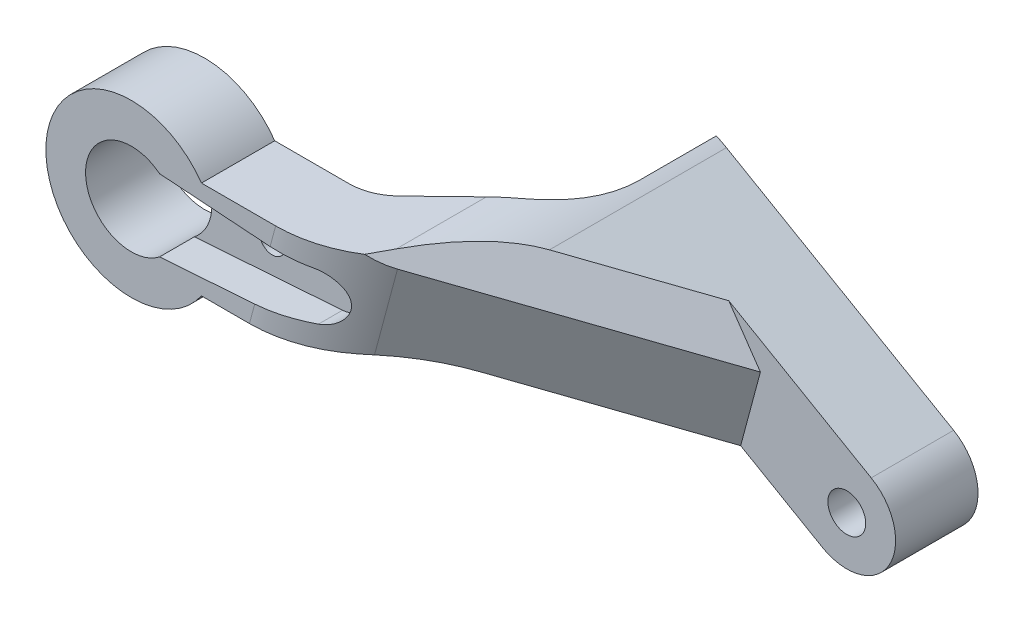
ISO-10303-21;
HEADER;
FILE_DESCRIPTION(('STEP AP214'),'2;1');
FILE_NAME('part.step','',(''),(''),'','','');
FILE_SCHEMA(('AUTOMOTIVE_DESIGN { 1 0 10303 214 1 1 1 1 }'));
ENDSEC;
DATA;
#1=APPLICATION_CONTEXT('core data for automotive mechanical design processes');
#2=APPLICATION_PROTOCOL_DEFINITION('international standard','automotive_design',2000,#1);
#3=PRODUCT_CONTEXT('',#1,'mechanical');
#4=PRODUCT('Part','Part','',(#3));
#5=PRODUCT_RELATED_PRODUCT_CATEGORY('part','',(#4));
#6=PRODUCT_DEFINITION_FORMATION('','',#4);
#7=PRODUCT_DEFINITION_CONTEXT('part definition',#1,'design');
#8=PRODUCT_DEFINITION('design','',#6,#7);
#9=PRODUCT_DEFINITION_SHAPE('','',#8);
#10=(LENGTH_UNIT() NAMED_UNIT(*) SI_UNIT(.MILLI.,.METRE.));
#11=(NAMED_UNIT(*) PLANE_ANGLE_UNIT() SI_UNIT($,.RADIAN.));
#12=(NAMED_UNIT(*) SI_UNIT($,.STERADIAN.) SOLID_ANGLE_UNIT());
#13=UNCERTAINTY_MEASURE_WITH_UNIT(LENGTH_MEASURE(1.E-05),#10,'distance_accuracy_value','');
#14=(GEOMETRIC_REPRESENTATION_CONTEXT(3) GLOBAL_UNCERTAINTY_ASSIGNED_CONTEXT((#13)) GLOBAL_UNIT_ASSIGNED_CONTEXT((#10,
#11,#12)) REPRESENTATION_CONTEXT('',''));
#15=CARTESIAN_POINT('',(0.,0.,0.));
#16=DIRECTION('',(0.,0.,1.));
#17=DIRECTION('',(1.,0.,0.));
#18=AXIS2_PLACEMENT_3D('',#15,#16,#17);
#19=CARTESIAN_POINT('',(0.,0.,-25.35));
#20=DIRECTION('',(0.,0.,1.));
#21=DIRECTION('',(1.,0.,0.));
#22=AXIS2_PLACEMENT_3D('',#19,#20,#21);
#23=PLANE('',#22);
#24=DIRECTION('',(-0.258819045102521,-0.965925826289068,0.));
#25=VECTOR('',#24,1.);
#26=CARTESIAN_POINT('',(17.8819508450437,-14.4014203161296,-25.35));
#27=LINE('',#26,#25);
#28=CARTESIAN_POINT('',(22.5678321839119,3.08652691876553,-25.35));
#29=VERTEX_POINT('',#28);
#30=CARTESIAN_POINT('',(20.4242386444629,-4.91347308123447,-25.35));
#31=VERTEX_POINT('',#30);
#32=EDGE_CURVE('E279',#29,#31,#27,.T.);
#33=ORIENTED_EDGE('',*,*,#32,.F.);
#34=CARTESIAN_POINT('',(18.3923048454133,-6.,-25.35));
#35=DIRECTION('',(0.,0.,1.));
#36=DIRECTION('',(1.,0.,0.));
#37=AXIS2_PLACEMENT_3D('',#34,#35,#36);
#38=CIRCLE('',#37,10.);
#39=CARTESIAN_POINT('',(23.3923048454133,2.66025403784438,-25.35));
#40=VERTEX_POINT('',#39);
#41=EDGE_CURVE('E317',#29,#40,#38,.F.);
#42=ORIENTED_EDGE('',*,*,#41,.T.);
#43=DIRECTION('',(-0.866025403784438,0.500000000000001,0.));
#44=VECTOR('',#43,1.);
#45=CARTESIAN_POINT('',(7.00000000000003,12.1243556529822,-25.35));
#46=LINE('',#45,#44);
#47=CARTESIAN_POINT('',(42.,-8.0829037686548,-25.35));
#48=VERTEX_POINT('',#47);
#49=EDGE_CURVE('E289',#48,#40,#46,.T.);
#50=ORIENTED_EDGE('',*,*,#49,.F.);
#51=CARTESIAN_POINT('',(40.,-11.5470053837925,-25.35));
#52=DIRECTION('',(0.,0.,1.));
#53=DIRECTION('',(1.,0.,0.));
#54=AXIS2_PLACEMENT_3D('',#51,#52,#53);
#55=CIRCLE('',#54,4.);
#56=CARTESIAN_POINT('',(38.,-15.0111069989303,-25.35));
#57=VERTEX_POINT('',#56);
#58=EDGE_CURVE('E288',#48,#57,#55,.F.);
#59=ORIENTED_EDGE('',*,*,#58,.T.);
#60=DIRECTION('',(-0.866025403784438,0.500000000000001,0.));
#61=VECTOR('',#60,1.);
#62=CARTESIAN_POINT('',(3.00000000000002,5.19615242270665,-25.35));
#63=LINE('',#62,#61);
#64=CARTESIAN_POINT('',(21.2487113059643,-5.33974596215562,-25.35));
#65=VERTEX_POINT('',#64);
#66=EDGE_CURVE('E284',#57,#65,#63,.T.);
#67=ORIENTED_EDGE('',*,*,#66,.T.);
#68=CARTESIAN_POINT('',(16.2487113059643,-14.,-25.35));
#69=DIRECTION('',(0.,0.,1.));
#70=DIRECTION('',(1.,0.,0.));
#71=AXIS2_PLACEMENT_3D('',#68,#69,#70);
#72=CIRCLE('',#71,10.);
#73=EDGE_CURVE('E326',#65,#31,#72,.T.);
#74=ORIENTED_EDGE('',*,*,#73,.T.);
#75=EDGE_LOOP('',(#33,#42,#50,#59,#67,#74));
#76=FACE_BOUND('',#75,.T.);
#77=CARTESIAN_POINT('',(40.,-11.5470053837925,-25.35));
#78=DIRECTION('',(0.,0.,1.));
#79=DIRECTION('',(1.,0.,0.));
#80=AXIS2_PLACEMENT_3D('',#77,#78,#79);
#81=CIRCLE('',#80,1.55);
#82=CARTESIAN_POINT('',(41.55,-11.5470053837925,-25.35));
#83=VERTEX_POINT('',#82);
#84=EDGE_CURVE('E283',#83,#83,#81,.F.);
#85=ORIENTED_EDGE('',*,*,#84,.F.);
#86=EDGE_LOOP('',(#85));
#87=FACE_BOUND('',#86,.T.);
#88=ADVANCED_FACE('F41',(#76,#87),#23,.F.);
#89=CARTESIAN_POINT('',(14.3,0.,-2.85));
#90=DIRECTION('',(0.,0.,1.));
#91=DIRECTION('',(1.,0.,0.));
#92=AXIS2_PLACEMENT_3D('',#89,#90,#91);
#93=PLANE('',#92);
#94=CARTESIAN_POINT('',(8.7,0.,-2.85));
#95=DIRECTION('',(0.,0.,1.));
#96=DIRECTION('',(1.,0.,0.));
#97=AXIS2_PLACEMENT_3D('',#94,#95,#96);
#98=CIRCLE('',#97,1.05);
#99=CARTESIAN_POINT('',(9.75,0.,-2.85));
#100=VERTEX_POINT('',#99);
#101=EDGE_CURVE('E755',#100,#100,#98,.T.);
#102=ORIENTED_EDGE('',*,*,#101,.F.);
#103=EDGE_LOOP('',(#102));
#104=FACE_BOUND('',#103,.T.);
#105=CARTESIAN_POINT('',(14.3,0.,-2.85));
#106=DIRECTION('',(0.,0.,1.));
#107=DIRECTION('',(1.,0.,0.));
#108=AXIS2_PLACEMENT_3D('',#105,#106,#107);
#109=CIRCLE('',#108,2.1);
#110=CARTESIAN_POINT('',(14.4476588758594,-2.09480234303381,-2.85));
#111=VERTEX_POINT('',#110);
#112=CARTESIAN_POINT('',(14.4476588758594,2.09480234303381,-2.85));
#113=VERTEX_POINT('',#112);
#114=EDGE_CURVE('E193',#111,#113,#109,.T.);
#115=ORIENTED_EDGE('',*,*,#114,.T.);
#116=DIRECTION('',(-0.997524925254196,0.0703137504092331,0.));
#117=VECTOR('',#116,1.);
#118=CARTESIAN_POINT('',(0.21835841186094,3.09780031931858,-2.85));
#119=LINE('',#118,#117);
#120=CARTESIAN_POINT('',(2.31516738055804,2.95,-2.85));
#121=VERTEX_POINT('',#120);
#122=EDGE_CURVE('E202',#113,#121,#119,.T.);
#123=ORIENTED_EDGE('',*,*,#122,.T.);
#124=CARTESIAN_POINT('',(0.,0.,-2.85));
#125=DIRECTION('',(0.,0.,1.));
#126=DIRECTION('',(1.,0.,0.));
#127=AXIS2_PLACEMENT_3D('',#124,#125,#126);
#128=CIRCLE('',#127,3.75);
#129=CARTESIAN_POINT('',(2.31516738055804,-2.95,-2.85));
#130=VERTEX_POINT('',#129);
#131=EDGE_CURVE('E208',#130,#121,#128,.T.);
#132=ORIENTED_EDGE('',*,*,#131,.F.);
#133=DIRECTION('',(-0.997524925254196,-0.0703137504092332,0.));
#134=VECTOR('',#133,1.);
#135=CARTESIAN_POINT('',(0.21835841186094,-3.09780031931858,-2.85));
#136=LINE('',#135,#134);
#137=EDGE_CURVE('E199',#111,#130,#136,.T.);
#138=ORIENTED_EDGE('',*,*,#137,.F.);
#139=EDGE_LOOP('',(#115,#123,#132,#138));
#140=FACE_BOUND('',#139,.T.);
#141=ADVANCED_FACE('F211',(#104,#140),#93,.T.);
#142=CARTESIAN_POINT('',(0.21835841186094,3.09780031931858,-2.85));
#143=DIRECTION('',(0.0703137504092331,0.997524925254195,0.));
#144=DIRECTION('',(-0.997524925254195,0.0703137504092331,0.));
#145=AXIS2_PLACEMENT_3D('',#142,#143,#144);
#146=PLANE('',#145);
#147=DIRECTION('',(0.,0.,1.));
#148=VECTOR('',#147,1.);
#149=CARTESIAN_POINT('',(14.4476588758594,2.09480234303381,-2.85));
#150=LINE('',#149,#148);
#151=CARTESIAN_POINT('',(14.4476588758594,2.09480234303381,-0.470002163302506));
#152=VERTEX_POINT('',#151);
#153=EDGE_CURVE('E188',#113,#152,#150,.T.);
#154=ORIENTED_EDGE('',*,*,#153,.T.);
#155=CARTESIAN_POINT('',(11.3692158806194,2.31179629169249,-10.));
#156=DIRECTION('',(0.0703137504092331,0.997524925254195,0.));
#157=DIRECTION('',(0.997524925254196,-0.0703137504092331,0.));
#158=AXIS2_PLACEMENT_3D('',#155,#156,#157);
#159=ELLIPSE('',#158,10.1860624319942,10.);
#160=CARTESIAN_POINT('',(11.3692158806194,2.31179629169249,0.));
#161=VERTEX_POINT('',#160);
#162=EDGE_CURVE('E731',#152,#161,#159,.F.);
#163=ORIENTED_EDGE('',*,*,#162,.T.);
#164=DIRECTION('',(-0.997524925254196,0.0703137504092331,0.));
#165=VECTOR('',#164,1.);
#166=CARTESIAN_POINT('',(0.21835841186094,3.09780031931858,0.));
#167=LINE('',#166,#165);
#168=CARTESIAN_POINT('',(2.31516738055804,2.95,0.));
#169=VERTEX_POINT('',#168);
#170=EDGE_CURVE('E214',#161,#169,#167,.T.);
#171=ORIENTED_EDGE('',*,*,#170,.T.);
#172=DIRECTION('',(0.,0.,1.));
#173=VECTOR('',#172,1.);
#174=CARTESIAN_POINT('',(2.31516738055804,2.95,-2.85));
#175=LINE('',#174,#173);
#176=EDGE_CURVE('E198',#121,#169,#175,.T.);
#177=ORIENTED_EDGE('',*,*,#176,.F.);
#178=ORIENTED_EDGE('',*,*,#122,.F.);
#179=EDGE_LOOP('',(#154,#163,#171,#177,#178));
#180=FACE_BOUND('',#179,.T.);
#181=ADVANCED_FACE('F203',(#180),#146,.F.);
#182=CARTESIAN_POINT('',(0.21835841186094,-3.09780031931858,-2.85));
#183=DIRECTION('',(-0.0703137504092331,0.997524925254195,0.));
#184=DIRECTION('',(-0.997524925254195,-0.0703137504092331,0.));
#185=AXIS2_PLACEMENT_3D('',#182,#183,#184);
#186=PLANE('',#185);
#187=DIRECTION('',(-0.997524925254196,-0.0703137504092332,0.));
#188=VECTOR('',#187,1.);
#189=CARTESIAN_POINT('',(0.21835841186094,-3.09780031931858,0.));
#190=LINE('',#189,#188);
#191=CARTESIAN_POINT('',(10.106478329303,-2.40080440644511,0.));
#192=VERTEX_POINT('',#191);
#193=CARTESIAN_POINT('',(2.31516738055804,-2.95,0.));
#194=VERTEX_POINT('',#193);
#195=EDGE_CURVE('E212',#192,#194,#190,.T.);
#196=ORIENTED_EDGE('',*,*,#195,.F.);
#197=CARTESIAN_POINT('',(10.106478329303,-2.40080440644511,-10.));
#198=DIRECTION('',(-0.0703137504092331,0.997524925254195,0.));
#199=DIRECTION('',(0.997524925254196,0.0703137504092331,0.));
#200=AXIS2_PLACEMENT_3D('',#197,#198,#199);
#201=ELLIPSE('',#200,10.5782432729629,10.);
#202=CARTESIAN_POINT('',(14.4476588758594,-2.09480234303381,-0.885477712381079));
#203=VERTEX_POINT('',#202);
#204=EDGE_CURVE('E732',#192,#203,#201,.T.);
#205=ORIENTED_EDGE('',*,*,#204,.T.);
#206=DIRECTION('',(0.,0.,1.));
#207=VECTOR('',#206,1.);
#208=CARTESIAN_POINT('',(14.4476588758594,-2.09480234303381,-2.85));
#209=LINE('',#208,#207);
#210=EDGE_CURVE('E223',#111,#203,#209,.T.);
#211=ORIENTED_EDGE('',*,*,#210,.F.);
#212=ORIENTED_EDGE('',*,*,#137,.T.);
#213=DIRECTION('',(0.,0.,1.));
#214=VECTOR('',#213,1.);
#215=CARTESIAN_POINT('',(2.31516738055804,-2.95,-2.85));
#216=LINE('',#215,#214);
#217=EDGE_CURVE('E226',#130,#194,#216,.T.);
#218=ORIENTED_EDGE('',*,*,#217,.T.);
#219=EDGE_LOOP('',(#196,#205,#211,#212,#218));
#220=FACE_BOUND('',#219,.T.);
#221=ADVANCED_FACE('F537',(#220),#186,.T.);
#222=CARTESIAN_POINT('',(0.,0.,-10.));
#223=DIRECTION('',(0.,0.,1.));
#224=DIRECTION('',(1.,0.,0.));
#225=AXIS2_PLACEMENT_3D('',#222,#223,#224);
#226=CYLINDRICAL_SURFACE('',#225,3.75);
#227=CARTESIAN_POINT('',(0.,0.,-6.));
#228=DIRECTION('',(0.,0.,1.));
#229=DIRECTION('',(1.,0.,0.));
#230=AXIS2_PLACEMENT_3D('',#227,#228,#229);
#231=CIRCLE('',#230,3.75);
#232=CARTESIAN_POINT('',(3.75,0.,-6.));
#233=VERTEX_POINT('',#232);
#234=EDGE_CURVE('E232',#233,#233,#231,.T.);
#235=ORIENTED_EDGE('',*,*,#234,.F.);
#236=EDGE_LOOP('',(#235));
#237=FACE_BOUND('',#236,.T.);
#238=ORIENTED_EDGE('',*,*,#217,.F.);
#239=ORIENTED_EDGE('',*,*,#131,.T.);
#240=ORIENTED_EDGE('',*,*,#176,.T.);
#241=CARTESIAN_POINT('',(0.,0.,0.));
#242=DIRECTION('',(0.,0.,1.));
#243=DIRECTION('',(1.,0.,0.));
#244=AXIS2_PLACEMENT_3D('',#241,#242,#243);
#245=CIRCLE('',#244,3.75);
#246=EDGE_CURVE('E225',#169,#194,#245,.T.);
#247=ORIENTED_EDGE('',*,*,#246,.T.);
#248=EDGE_LOOP('',(#238,#239,#240,#247));
#249=FACE_BOUND('',#248,.T.);
#250=ADVANCED_FACE('F545',(#237,#249),#226,.F.);
#251=CARTESIAN_POINT('',(8.7,0.,-12.85));
#252=DIRECTION('',(0.,0.,1.));
#253=DIRECTION('',(1.,0.,0.));
#254=AXIS2_PLACEMENT_3D('',#251,#252,#253);
#255=CYLINDRICAL_SURFACE('',#254,1.05);
#256=ORIENTED_EDGE('',*,*,#101,.T.);
#257=EDGE_LOOP('',(#256));
#258=FACE_BOUND('',#257,.T.);
#259=CARTESIAN_POINT('',(8.7,0.,-6.));
#260=DIRECTION('',(0.,0.,1.));
#261=DIRECTION('',(1.,0.,0.));
#262=AXIS2_PLACEMENT_3D('',#259,#260,#261);
#263=CIRCLE('',#262,1.05);
#264=CARTESIAN_POINT('',(9.75,0.,-6.));
#265=VERTEX_POINT('',#264);
#266=EDGE_CURVE('E217',#265,#265,#263,.T.);
#267=ORIENTED_EDGE('',*,*,#266,.F.);
#268=EDGE_LOOP('',(#267));
#269=FACE_BOUND('',#268,.T.);
#270=ADVANCED_FACE('F481',(#258,#269),#255,.F.);
#271=CARTESIAN_POINT('',(0.,0.,-49.));
#272=DIRECTION('',(0.,0.,1.));
#273=DIRECTION('',(1.,0.,0.));
#274=AXIS2_PLACEMENT_3D('',#271,#272,#273);
#275=CYLINDRICAL_SURFACE('',#274,7.);
#276=DIRECTION('',(0.,0.,1.));
#277=VECTOR('',#276,1.);
#278=CARTESIAN_POINT('',(5.74456264653803,4.,-49.));
#279=LINE('',#278,#277);
#280=CARTESIAN_POINT('',(5.74456264653803,4.,-6.00000000000001));
#281=VERTEX_POINT('',#280);
#282=CARTESIAN_POINT('',(5.74456264653803,4.,0.));
#283=VERTEX_POINT('',#282);
#284=EDGE_CURVE('E270',#281,#283,#279,.T.);
#285=ORIENTED_EDGE('',*,*,#284,.F.);
#286=CARTESIAN_POINT('',(0.,0.,-6.00000000000001));
#287=DIRECTION('',(0.,0.,1.));
#288=DIRECTION('',(1.,0.,0.));
#289=AXIS2_PLACEMENT_3D('',#286,#287,#288);
#290=CIRCLE('',#289,7.);
#291=CARTESIAN_POINT('',(5.74456264653803,-4.,-6.00000000000001));
#292=VERTEX_POINT('',#291);
#293=EDGE_CURVE('E252',#292,#281,#290,.F.);
#294=ORIENTED_EDGE('',*,*,#293,.F.);
#295=DIRECTION('',(0.,0.,1.));
#296=VECTOR('',#295,1.);
#297=CARTESIAN_POINT('',(5.74456264653803,-4.,-49.));
#298=LINE('',#297,#296);
#299=CARTESIAN_POINT('',(5.74456264653803,-4.,0.));
#300=VERTEX_POINT('',#299);
#301=EDGE_CURVE('E267',#292,#300,#298,.T.);
#302=ORIENTED_EDGE('',*,*,#301,.T.);
#303=CARTESIAN_POINT('',(0.,0.,0.));
#304=DIRECTION('',(0.,0.,1.));
#305=DIRECTION('',(1.,0.,0.));
#306=AXIS2_PLACEMENT_3D('',#303,#304,#305);
#307=CIRCLE('',#306,7.);
#308=EDGE_CURVE('E260',#283,#300,#307,.T.);
#309=ORIENTED_EDGE('',*,*,#308,.F.);
#310=EDGE_LOOP('',(#285,#294,#302,#309));
#311=FACE_BOUND('',#310,.T.);
#312=ADVANCED_FACE('F478',(#311),#275,.T.);
#313=CARTESIAN_POINT('',(14.3,0.,-2.85));
#314=DIRECTION('',(0.,0.,1.));
#315=DIRECTION('',(1.,0.,0.));
#316=AXIS2_PLACEMENT_3D('',#313,#314,#315);
#317=CYLINDRICAL_SURFACE('',#316,2.1);
#318=ORIENTED_EDGE('',*,*,#210,.T.);
#319=CARTESIAN_POINT('',(14.4476588758594,-2.09480234303381,-0.885477712381079));
#320=CARTESIAN_POINT('',(14.5110638418506,-2.09032718876905,-0.912596074185811));
#321=CARTESIAN_POINT('',(14.5741253856427,-2.08299398658678,-0.939952778841386));
#322=CARTESIAN_POINT('',(14.6992478739881,-2.06267465132273,-0.994869693085477));
#323=CARTESIAN_POINT('',(14.7613087331593,-2.0496880384903,-1.02242991974979));
#324=CARTESIAN_POINT('',(14.9460113863559,-2.00221417464057,-1.1052267235886));
#325=CARTESIAN_POINT('',(15.0666433708133,-1.9592507862644,-1.16035050848793));
#326=CARTESIAN_POINT('',(15.2994171277795,-1.85139619486452,-1.26737615733335));
#327=CARTESIAN_POINT('',(15.4115474060476,-1.78647593139322,-1.31927364287009));
#328=CARTESIAN_POINT('',(15.6236670646593,-1.63547246290233,-1.41624300284834));
#329=CARTESIAN_POINT('',(15.7236859295596,-1.54944226140477,-1.46133152234145));
#330=CARTESIAN_POINT('',(15.8870185410784,-1.37913144972467,-1.53181609061842));
#331=CARTESIAN_POINT('',(15.953530651556,-1.29879830795271,-1.55936056130912));
#332=CARTESIAN_POINT('',(16.0747720763172,-1.12746227901934,-1.60603208794374));
#333=CARTESIAN_POINT('',(16.1295087416943,-1.036466103637,-1.62516440320306));
#334=CARTESIAN_POINT('',(16.2252611617978,-0.845475224971784,-1.65341579659099));
#335=CARTESIAN_POINT('',(16.2662106115561,-0.74543989139331,-1.66248695487754));
#336=CARTESIAN_POINT('',(16.3322767250431,-0.539900150973491,-1.66952697118877));
#337=CARTESIAN_POINT('',(16.357397518582,-0.434397178459478,-1.66749872646614));
#338=CARTESIAN_POINT('',(16.3896859212667,-0.230262783844825,-1.6531804748317));
#339=CARTESIAN_POINT('',(16.398148002961,-0.131770728836464,-1.64173885743886));
#340=CARTESIAN_POINT('',(16.4013068809453,0.0641047844770845,-1.6106383852458));
#341=CARTESIAN_POINT('',(16.3960011942506,0.161488039631642,-1.59097804875533));
#342=CARTESIAN_POINT('',(16.3718637976183,0.357086133414157,-1.54383966455514));
#343=CARTESIAN_POINT('',(16.3524588866797,0.455155863816122,-1.51606115476708));
#344=CARTESIAN_POINT('',(16.3006440120909,0.645914934387876,-1.45482603372333));
#345=CARTESIAN_POINT('',(16.2682282267821,0.738601844758897,-1.4213668845626));
#346=CARTESIAN_POINT('',(16.186087423663,0.930063210084562,-1.3453682789971));
#347=CARTESIAN_POINT('',(16.1345514768037,1.02781643330132,-1.30221445946862));
#348=CARTESIAN_POINT('',(16.0176521371022,1.21313191494271,-1.21287397249149));
#349=CARTESIAN_POINT('',(15.9522814522584,1.30068876119187,-1.1666857145417));
#350=CARTESIAN_POINT('',(15.7994872957533,1.47538163460228,-1.06685200226206));
#351=CARTESIAN_POINT('',(15.7102788435291,1.56086929469766,-1.01304073997503));
#352=CARTESIAN_POINT('',(15.5178842627748,1.71521963787836,-0.906278907224791));
#353=CARTESIAN_POINT('',(15.4146856775065,1.78406735106158,-0.853329151443879));
#354=CARTESIAN_POINT('',(15.1921670016923,1.90545409448161,-0.748246359815534));
#355=CARTESIAN_POINT('',(15.0723598829231,1.95721010062045,-0.696235497453027));
#356=CARTESIAN_POINT('',(14.823534943806,2.03786900869596,-0.597436931534504));
#357=CARTESIAN_POINT('',(14.6945453559902,2.06683891858088,-0.550634263192985));
#358=CARTESIAN_POINT('',(14.5248063430596,2.08829375506303,-0.494475675906626));
#359=CARTESIAN_POINT('',(14.4863085571081,2.0920852055504,-0.482088667740718));
#360=CARTESIAN_POINT('',(14.4476588758594,2.09480234303381,-0.470002163302506));
#361=B_SPLINE_CURVE_WITH_KNOTS('',3,(#319,#320,#321,#322,#323,#324,#325,#326,#327,#328,#329,
#330,#331,#332,#333,#334,#335,#336,#337,#338,#339,#340,#341,#342,#343,#344,#345,#346,#347,#348,
#349,#350,#351,#352,#353,#354,#355,#356,#357,#358,#359,#360),.UNSPECIFIED.,.F.,.F.,(4,2,2,2,2,2,
2,2,2,2,2,2,2,2,2,2,2,2,2,2,4),(0.,0.207185845459151,0.414389276219694,0.830510218592322,
1.24718407630738,1.6628222529011,1.98510111819791,2.30717820586969,2.63078279954973,
2.95430292746622,3.25149942096883,3.54874951688516,3.85881303201607,4.16901543864523,
4.5235219989365,4.87821587967857,5.28073196789139,5.6836088374729,6.10297860666666,
6.52111045949849,6.64290480646933),.UNSPECIFIED.);
#362=EDGE_CURVE('E195',#203,#152,#361,.T.);
#363=ORIENTED_EDGE('',*,*,#362,.T.);
#364=ORIENTED_EDGE('',*,*,#153,.F.);
#365=ORIENTED_EDGE('',*,*,#114,.F.);
#366=EDGE_LOOP('',(#318,#363,#364,#365));
#367=FACE_BOUND('',#366,.T.);
#368=ADVANCED_FACE('F191',(#367),#317,.F.);
#369=CARTESIAN_POINT('',(0.,0.,0.));
#370=DIRECTION('',(0.,0.,1.));
#371=DIRECTION('',(1.,0.,0.));
#372=AXIS2_PLACEMENT_3D('',#369,#370,#371);
#373=PLANE('',#372);
#374=DIRECTION('',(1.,0.,0.));
#375=VECTOR('',#374,1.);
#376=CARTESIAN_POINT('',(0.,-4.,0.));
#377=LINE('',#376,#375);
#378=CARTESIAN_POINT('',(9.6779751614706,-4.,0.));
#379=VERTEX_POINT('',#378);
#380=EDGE_CURVE('E263',#300,#379,#377,.T.);
#381=ORIENTED_EDGE('',*,*,#380,.T.);
#382=DIRECTION('',(0.258819045102521,0.965925826289068,0.));
#383=VECTOR('',#382,1.);
#384=CARTESIAN_POINT('',(9.89222674538682,-3.20040220322255,0.));
#385=LINE('',#384,#383);
#386=EDGE_CURVE('E740',#379,#192,#385,.T.);
#387=ORIENTED_EDGE('',*,*,#386,.T.);
#388=ORIENTED_EDGE('',*,*,#195,.T.);
#389=ORIENTED_EDGE('',*,*,#246,.F.);
#390=ORIENTED_EDGE('',*,*,#170,.F.);
#391=DIRECTION('',(-0.258819045102521,-0.965925826289068,0.));
#392=VECTOR('',#391,1.);
#393=CARTESIAN_POINT('',(12.1088272732426,5.07206358681918,0.));
#394=LINE('',#393,#392);
#395=CARTESIAN_POINT('',(11.8215687009196,4.,0.));
#396=VERTEX_POINT('',#395);
#397=EDGE_CURVE('E738',#161,#396,#394,.F.);
#398=ORIENTED_EDGE('',*,*,#397,.T.);
#399=DIRECTION('',(1.,0.,0.));
#400=VECTOR('',#399,1.);
#401=CARTESIAN_POINT('',(0.,4.,0.));
#402=LINE('',#401,#400);
#403=EDGE_CURVE('E257',#283,#396,#402,.T.);
#404=ORIENTED_EDGE('',*,*,#403,.F.);
#405=ORIENTED_EDGE('',*,*,#308,.T.);
#406=EDGE_LOOP('',(#381,#387,#388,#389,#390,#398,#404,#405));
#407=FACE_BOUND('',#406,.T.);
#408=ADVANCED_FACE('F471',(#407),#373,.T.);
#409=CARTESIAN_POINT('',(-9.16397229105025,-7.154487053259,-6.));
#410=DIRECTION('',(0.,0.,1.));
#411=DIRECTION('',(1.,0.,0.));
#412=AXIS2_PLACEMENT_3D('',#409,#410,#411);
#413=PLANE('',#412);
#414=ORIENTED_EDGE('',*,*,#266,.T.);
#415=EDGE_LOOP('',(#414));
#416=FACE_BOUND('',#415,.T.);
#417=ORIENTED_EDGE('',*,*,#234,.T.);
#418=EDGE_LOOP('',(#417));
#419=FACE_BOUND('',#418,.T.);
#420=DIRECTION('',(-1.,0.,0.));
#421=VECTOR('',#420,1.);
#422=CARTESIAN_POINT('',(0.,4.,-6.00000000000001));
#423=LINE('',#422,#421);
#424=CARTESIAN_POINT('',(11.8215687009196,4.,-6.00000000000001));
#425=VERTEX_POINT('',#424);
#426=EDGE_CURVE('E277',#425,#281,#423,.T.);
#427=ORIENTED_EDGE('',*,*,#426,.F.);
#428=DIRECTION('',(0.258819045102521,0.965925826289068,0.));
#429=VECTOR('',#428,1.);
#430=CARTESIAN_POINT('',(9.79287859039981,-3.57117456527233,-6.));
#431=LINE('',#430,#429);
#432=CARTESIAN_POINT('',(9.6779751614706,-4.,-6.00000000000001));
#433=VERTEX_POINT('',#432);
#434=EDGE_CURVE('E62',#425,#433,#431,.F.);
#435=ORIENTED_EDGE('',*,*,#434,.T.);
#436=DIRECTION('',(-1.,0.,0.));
#437=VECTOR('',#436,1.);
#438=CARTESIAN_POINT('',(0.,-4.,-6.00000000000001));
#439=LINE('',#438,#437);
#440=EDGE_CURVE('E255',#433,#292,#439,.T.);
#441=ORIENTED_EDGE('',*,*,#440,.T.);
#442=ORIENTED_EDGE('',*,*,#293,.T.);
#443=EDGE_LOOP('',(#427,#435,#441,#442));
#444=FACE_BOUND('',#443,.T.);
#445=ADVANCED_FACE('F474',(#416,#419,#444),#413,.F.);
#446=CARTESIAN_POINT('',(0.,4.,-49.));
#447=DIRECTION('',(0.,-1.,0.));
#448=DIRECTION('',(0.,0.,-1.));
#449=AXIS2_PLACEMENT_3D('',#446,#447,#448);
#450=PLANE('',#449);
#451=ORIENTED_EDGE('',*,*,#403,.T.);
#452=CARTESIAN_POINT('',(11.8215687009196,4.,-10.));
#453=DIRECTION('',(0.,-1.,0.));
#454=DIRECTION('',(1.,0.,0.));
#455=AXIS2_PLACEMENT_3D('',#452,#453,#454);
#456=ELLIPSE('',#455,10.3527618041008,10.);
#457=CARTESIAN_POINT('',(17.4810445215168,4.,-1.62647539810829));
#458=VERTEX_POINT('',#457);
#459=EDGE_CURVE('E735',#396,#458,#456,.F.);
#460=ORIENTED_EDGE('',*,*,#459,.T.);
#461=DIRECTION('',(-0.475576474947911,0.,0.879674380936559));
#462=VECTOR('',#461,1.);
#463=CARTESIAN_POINT('',(28.240058355751,4.,-21.5274363006727));
#464=LINE('',#463,#462);
#465=CARTESIAN_POINT('',(18.3923048454133,4.,-3.31203472141892));
#466=VERTEX_POINT('',#465);
#467=EDGE_CURVE('E300',#458,#466,#464,.F.);
#468=ORIENTED_EDGE('',*,*,#467,.T.);
#469=DIRECTION('',(0.,0.,1.));
#470=VECTOR('',#469,1.);
#471=CARTESIAN_POINT('',(18.3923048454133,4.,-49.));
#472=LINE('',#471,#470);
#473=CARTESIAN_POINT('',(18.3923048454133,4.,-10.6899894902051));
#474=VERTEX_POINT('',#473);
#475=EDGE_CURVE('E310',#466,#474,#472,.F.);
#476=ORIENTED_EDGE('',*,*,#475,.T.);
#477=DIRECTION('',(-0.719254596676403,0.,0.694746590606866));
#478=VECTOR('',#477,1.);
#479=CARTESIAN_POINT('',(28.0209656882436,4.,-19.9905616708732));
#480=LINE('',#479,#478);
#481=CARTESIAN_POINT('',(14.7497719311951,4.,-7.17157287525382));
#482=VERTEX_POINT('',#481);
#483=EDGE_CURVE('E247',#474,#482,#480,.T.);
#484=ORIENTED_EDGE('',*,*,#483,.T.);
#485=CARTESIAN_POINT('',(11.8215687009196,4.,-10.));
#486=DIRECTION('',(0.,-1.,0.));
#487=DIRECTION('',(-1.,0.,0.));
#488=AXIS2_PLACEMENT_3D('',#485,#486,#487);
#489=ELLIPSE('',#488,4.14110472164033,4.);
#490=EDGE_CURVE('E49',#482,#425,#489,.T.);
#491=ORIENTED_EDGE('',*,*,#490,.T.);
#492=ORIENTED_EDGE('',*,*,#426,.T.);
#493=ORIENTED_EDGE('',*,*,#284,.T.);
#494=EDGE_LOOP('',(#451,#460,#468,#476,#484,#491,#492,#493));
#495=FACE_BOUND('',#494,.T.);
#496=ADVANCED_FACE('F390',(#495),#450,.F.);
#497=CARTESIAN_POINT('',(0.,-4.,-49.));
#498=DIRECTION('',(0.,-1.,0.));
#499=DIRECTION('',(1.,0.,0.));
#500=AXIS2_PLACEMENT_3D('',#497,#498,#499);
#501=PLANE('',#500);
#502=DIRECTION('',(0.,0.,1.));
#503=VECTOR('',#502,1.);
#504=CARTESIAN_POINT('',(16.2487113059643,-4.,-4.79289856699176));
#505=LINE('',#504,#503);
#506=CARTESIAN_POINT('',(16.2487113059643,-4.,-10.6899894902051));
#507=VERTEX_POINT('',#506);
#508=CARTESIAN_POINT('',(16.2487113059643,-4.,-2.27228529616533));
#509=VERTEX_POINT('',#508);
#510=EDGE_CURVE('E319',#507,#509,#505,.T.);
#511=ORIENTED_EDGE('',*,*,#510,.T.);
#512=CARTESIAN_POINT('',(9.6779751614706,-4.,-10.));
#513=DIRECTION('',(0.,-1.,0.));
#514=DIRECTION('',(1.,0.,0.));
#515=AXIS2_PLACEMENT_3D('',#512,#513,#514);
#516=ELLIPSE('',#515,10.3527618041008,10.);
#517=EDGE_CURVE('E349',#509,#379,#516,.T.);
#518=ORIENTED_EDGE('',*,*,#517,.T.);
#519=ORIENTED_EDGE('',*,*,#380,.F.);
#520=ORIENTED_EDGE('',*,*,#301,.F.);
#521=ORIENTED_EDGE('',*,*,#440,.F.);
#522=CARTESIAN_POINT('',(9.6779751614706,-4.,-10.));
#523=DIRECTION('',(0.,-1.,0.));
#524=DIRECTION('',(-1.,0.,0.));
#525=AXIS2_PLACEMENT_3D('',#522,#523,#524);
#526=ELLIPSE('',#525,4.14110472164033,4.);
#527=CARTESIAN_POINT('',(12.6061783917461,-4.,-7.17157287525382));
#528=VERTEX_POINT('',#527);
#529=EDGE_CURVE('E11',#433,#528,#526,.F.);
#530=ORIENTED_EDGE('',*,*,#529,.T.);
#531=DIRECTION('',(-0.719254596676403,0.,0.694746590606866));
#532=VECTOR('',#531,1.);
#533=CARTESIAN_POINT('',(26.9863113385633,-4.,-21.0617146740549));
#534=LINE('',#533,#532);
#535=EDGE_CURVE('E249',#507,#528,#534,.T.);
#536=ORIENTED_EDGE('',*,*,#535,.F.);
#537=EDGE_LOOP('',(#511,#518,#519,#520,#521,#530,#536));
#538=FACE_BOUND('',#537,.T.);
#539=ADVANCED_FACE('F437',(#538),#501,.T.);
#540=CARTESIAN_POINT('',(11.6281780221764,-12.7257269385946,0.));
#541=DIRECTION('',(-0.68301270189222,0.18301270189222,-0.707106781186547));
#542=DIRECTION('',(-0.719254596676403,0.,0.694746590606866));
#543=AXIS2_PLACEMENT_3D('',#540,#541,#542);
#544=PLANE('',#543);
#545=DIRECTION('',(-0.622892752510496,0.359627298338203,0.694746590606866));
#546=VECTOR('',#545,1.);
#547=CARTESIAN_POINT('',(18.3174095589512,3.31984963787446,-2.30840069175695));
#548=LINE('',#547,#546);
#549=CARTESIAN_POINT('',(32.9240579011119,-5.11330271443026,-18.6));
#550=VERTEX_POINT('',#549);
#551=CARTESIAN_POINT('',(18.873762878311,2.9986388991775,-2.92893218813453));
#552=VERTEX_POINT('',#551);
#553=EDGE_CURVE('E297',#550,#552,#548,.T.);
#554=ORIENTED_EDGE('',*,*,#553,.T.);
#555=DIRECTION('',(-0.258819045102521,-0.965925826289068,0.));
#556=VECTOR('',#555,1.);
#557=CARTESIAN_POINT('',(18.3289639995816,0.965421803852829,-2.92893218813453));
#558=LINE('',#557,#556);
#559=CARTESIAN_POINT('',(16.9910893584533,-4.02759433099603,-2.92893218813452));
#560=VERTEX_POINT('',#559);
#561=EDGE_CURVE('E339',#552,#560,#558,.T.);
#562=ORIENTED_EDGE('',*,*,#561,.T.);
#563=CARTESIAN_POINT('',(16.2487113059643,-14.,-4.79289856699176));
#564=DIRECTION('',(-0.68301270189222,0.18301270189222,-0.707106781186547));
#565=DIRECTION('',(0.683012701892219,-0.183012701892219,-0.707106781186548));
#566=AXIS2_PLACEMENT_3D('',#563,#564,#565);
#567=ELLIPSE('',#566,14.142135623731,10.);
#568=CARTESIAN_POINT('',(21.2487113059643,-5.33974596215562,-7.38108901801699));
#569=VERTEX_POINT('',#568);
#570=EDGE_CURVE('E324',#560,#569,#567,.T.);
#571=ORIENTED_EDGE('',*,*,#570,.T.);
#572=DIRECTION('',(0.622892752510495,-0.359627298338203,-0.694746590606866));
#573=VECTOR('',#572,1.);
#574=CARTESIAN_POINT('',(29.8188496491114,-10.287717641564,-16.9398362837918));
#575=LINE('',#574,#573);
#576=CARTESIAN_POINT('',(31.3073117168471,-11.1470816170497,-18.6));
#577=VERTEX_POINT('',#576);
#578=EDGE_CURVE('E236',#569,#577,#575,.T.);
#579=ORIENTED_EDGE('',*,*,#578,.T.);
#580=DIRECTION('',(0.258819045102521,0.965925826289068,0.));
#581=VECTOR('',#580,1.);
#582=CARTESIAN_POINT('',(29.5943983911531,-17.5397611775015,-18.6));
#583=LINE('',#582,#581);
#584=EDGE_CURVE('E233',#577,#550,#583,.T.);
#585=ORIENTED_EDGE('',*,*,#584,.T.);
#586=EDGE_LOOP('',(#554,#562,#571,#579,#585));
#587=FACE_BOUND('',#586,.T.);
#588=ADVANCED_FACE('F418',(#587),#544,.F.);
#589=CARTESIAN_POINT('',(29.5943983911531,-17.5397611775015,-18.6));
#590=DIRECTION('',(0.,0.,-1.));
#591=DIRECTION('',(-1.,0.,0.));
#592=AXIS2_PLACEMENT_3D('',#589,#590,#591);
#593=PLANE('',#592);
#594=DIRECTION('',(0.866025403784438,-0.500000000000001,0.));
#595=VECTOR('',#594,1.);
#596=CARTESIAN_POINT('',(3.00000000000002,5.19615242270665,-18.6));
#597=LINE('',#596,#595);
#598=CARTESIAN_POINT('',(38.,-15.0111069989303,-18.6));
#599=VERTEX_POINT('',#598);
#600=EDGE_CURVE('E241',#577,#599,#597,.T.);
#601=ORIENTED_EDGE('',*,*,#600,.T.);
#602=CARTESIAN_POINT('',(40.,-11.5470053837925,-18.6));
#603=DIRECTION('',(0.,0.,-1.));
#604=DIRECTION('',(-1.,0.,0.));
#605=AXIS2_PLACEMENT_3D('',#602,#603,#604);
#606=CIRCLE('',#605,4.);
#607=CARTESIAN_POINT('',(42.,-8.0829037686548,-18.6));
#608=VERTEX_POINT('',#607);
#609=EDGE_CURVE('E269',#599,#608,#606,.F.);
#610=ORIENTED_EDGE('',*,*,#609,.T.);
#611=DIRECTION('',(0.866025403784438,-0.500000000000001,0.));
#612=VECTOR('',#611,1.);
#613=CARTESIAN_POINT('',(7.00000000000003,12.1243556529822,-18.6));
#614=LINE('',#613,#612);
#615=CARTESIAN_POINT('',(30.3349507982984,-1.34808447194214,-18.6));
#616=VERTEX_POINT('',#615);
#617=EDGE_CURVE('E238',#616,#608,#614,.T.);
#618=ORIENTED_EDGE('',*,*,#617,.F.);
#619=DIRECTION('',(-0.566606029132409,0.823988839579035,0.));
#620=VECTOR('',#619,1.);
#621=CARTESIAN_POINT('',(37.6567242467955,-11.9957996343197,-18.6));
#622=LINE('',#621,#620);
#623=EDGE_CURVE('E302',#616,#550,#622,.F.);
#624=ORIENTED_EDGE('',*,*,#623,.T.);
#625=ORIENTED_EDGE('',*,*,#584,.F.);
#626=EDGE_LOOP('',(#601,#610,#618,#624,#625));
#627=FACE_BOUND('',#626,.T.);
#628=CARTESIAN_POINT('',(40.,-11.5470053837925,-18.6));
#629=DIRECTION('',(0.,0.,-1.));
#630=DIRECTION('',(-1.,0.,0.));
#631=AXIS2_PLACEMENT_3D('',#628,#629,#630);
#632=CIRCLE('',#631,1.55);
#633=CARTESIAN_POINT('',(38.45,-11.5470053837925,-18.6));
#634=VERTEX_POINT('',#633);
#635=EDGE_CURVE('E244',#634,#634,#632,.F.);
#636=ORIENTED_EDGE('',*,*,#635,.F.);
#637=EDGE_LOOP('',(#636));
#638=FACE_BOUND('',#637,.T.);
#639=ADVANCED_FACE('F421',(#627,#638),#593,.F.);
#640=CARTESIAN_POINT('',(40.,-11.5470053837925,-49.));
#641=DIRECTION('',(0.,0.,1.));
#642=DIRECTION('',(1.,0.,0.));
#643=AXIS2_PLACEMENT_3D('',#640,#641,#642);
#644=CYLINDRICAL_SURFACE('',#643,1.55);
#645=ORIENTED_EDGE('',*,*,#84,.T.);
#646=EDGE_LOOP('',(#645));
#647=FACE_BOUND('',#646,.T.);
#648=ORIENTED_EDGE('',*,*,#635,.T.);
#649=EDGE_LOOP('',(#648));
#650=FACE_BOUND('',#649,.T.);
#651=ADVANCED_FACE('F470',(#647,#650),#644,.F.);
#652=CARTESIAN_POINT('',(40.,-11.5470053837925,-49.));
#653=DIRECTION('',(0.,0.,1.));
#654=DIRECTION('',(1.,0.,0.));
#655=AXIS2_PLACEMENT_3D('',#652,#653,#654);
#656=CYLINDRICAL_SURFACE('',#655,4.);
#657=ORIENTED_EDGE('',*,*,#58,.F.);
#658=DIRECTION('',(0.,0.,1.));
#659=VECTOR('',#658,1.);
#660=CARTESIAN_POINT('',(42.,-8.0829037686548,-49.));
#661=LINE('',#660,#659);
#662=EDGE_CURVE('E272',#48,#608,#661,.T.);
#663=ORIENTED_EDGE('',*,*,#662,.T.);
#664=ORIENTED_EDGE('',*,*,#609,.F.);
#665=DIRECTION('',(0.,0.,1.));
#666=VECTOR('',#665,1.);
#667=CARTESIAN_POINT('',(38.,-15.0111069989303,-49.));
#668=LINE('',#667,#666);
#669=EDGE_CURVE('E266',#57,#599,#668,.T.);
#670=ORIENTED_EDGE('',*,*,#669,.F.);
#671=EDGE_LOOP('',(#657,#663,#664,#670));
#672=FACE_BOUND('',#671,.T.);
#673=ADVANCED_FACE('F485',(#672),#656,.T.);
#674=CARTESIAN_POINT('',(9.22758055720418,-12.0824887865031,-6.));
#675=DIRECTION('',(0.68301270189222,-0.18301270189222,0.707106781186547));
#676=DIRECTION('',(0.719254596676403,0.,-0.694746590606866));
#677=AXIS2_PLACEMENT_3D('',#674,#675,#676);
#678=PLANE('',#677);
#679=ORIENTED_EDGE('',*,*,#535,.T.);
#680=DIRECTION('',(0.258819045102521,0.965925826289068,0.));
#681=VECTOR('',#680,1.);
#682=CARTESIAN_POINT('',(14.6685229374177,3.6967746271588,-7.17157287525381));
#683=LINE('',#682,#681);
#684=EDGE_CURVE('E373',#528,#482,#683,.T.);
#685=ORIENTED_EDGE('',*,*,#684,.T.);
#686=ORIENTED_EDGE('',*,*,#483,.F.);
#687=CARTESIAN_POINT('',(18.3923048454133,-6.,-13.2781799412303));
#688=DIRECTION('',(0.68301270189222,-0.18301270189222,0.707106781186547));
#689=DIRECTION('',(-0.683012701892219,0.183012701892219,0.707106781186548));
#690=AXIS2_PLACEMENT_3D('',#687,#688,#689);
#691=ELLIPSE('',#690,14.142135623731,10.);
#692=CARTESIAN_POINT('',(19.7553356267637,3.90667184724978,-12.0307312273145));
#693=VERTEX_POINT('',#692);
#694=EDGE_CURVE('E312',#474,#693,#691,.F.);
#695=ORIENTED_EDGE('',*,*,#694,.T.);
#696=DIRECTION('',(0.258819045102521,0.965925826289068,0.));
#697=VECTOR('',#696,1.);
#698=CARTESIAN_POINT('',(17.5951074004944,-4.15540964913146,-12.0307312273145));
#699=LINE('',#698,#697);
#700=CARTESIAN_POINT('',(17.6117420873147,-4.09332815275022,-12.0307312273145));
#701=VERTEX_POINT('',#700);
#702=EDGE_CURVE('E337',#693,#701,#699,.F.);
#703=ORIENTED_EDGE('',*,*,#702,.T.);
#704=CARTESIAN_POINT('',(16.2487113059643,-14.,-13.2781799412303));
#705=DIRECTION('',(0.68301270189222,-0.18301270189222,0.707106781186547));
#706=DIRECTION('',(0.683012701892219,-0.183012701892219,-0.707106781186548));
#707=AXIS2_PLACEMENT_3D('',#704,#705,#706);
#708=ELLIPSE('',#707,14.142135623731,10.);
#709=EDGE_CURVE('E332',#701,#507,#708,.T.);
#710=ORIENTED_EDGE('',*,*,#709,.T.);
#711=EDGE_LOOP('',(#679,#685,#686,#695,#703,#710));
#712=FACE_BOUND('',#711,.T.);
#713=ADVANCED_FACE('F385',(#712),#678,.F.);
#714=CARTESIAN_POINT('',(3.00000000000002,5.19615242270665,-49.));
#715=DIRECTION('',(-0.500000000000001,-0.866025403784438,0.));
#716=DIRECTION('',(0.866025403784438,-0.500000000000001,0.));
#717=AXIS2_PLACEMENT_3D('',#714,#715,#716);
#718=PLANE('',#717);
#719=ORIENTED_EDGE('',*,*,#578,.F.);
#720=DIRECTION('',(0.,0.,1.));
#721=VECTOR('',#720,1.);
#722=CARTESIAN_POINT('',(21.2487113059643,-5.33974596215562,-13.2781799412303));
#723=LINE('',#722,#721);
#724=EDGE_CURVE('E322',#569,#65,#723,.F.);
#725=ORIENTED_EDGE('',*,*,#724,.T.);
#726=ORIENTED_EDGE('',*,*,#66,.F.);
#727=ORIENTED_EDGE('',*,*,#669,.T.);
#728=ORIENTED_EDGE('',*,*,#600,.F.);
#729=EDGE_LOOP('',(#719,#725,#726,#727,#728));
#730=FACE_BOUND('',#729,.T.);
#731=ADVANCED_FACE('F414',(#730),#718,.T.);
#732=CARTESIAN_POINT('',(7.00000000000003,12.1243556529822,-49.));
#733=DIRECTION('',(-0.500000000000001,-0.866025403784438,0.));
#734=DIRECTION('',(0.866025403784438,-0.500000000000001,0.));
#735=AXIS2_PLACEMENT_3D('',#732,#733,#734);
#736=PLANE('',#735);
#737=ORIENTED_EDGE('',*,*,#49,.T.);
#738=DIRECTION('',(0.,0.,1.));
#739=VECTOR('',#738,1.);
#740=CARTESIAN_POINT('',(23.3923048454133,2.66025403784438,-49.));
#741=LINE('',#740,#739);
#742=CARTESIAN_POINT('',(23.3923048454133,2.66025403784438,-10.8564846257763));
#743=VERTEX_POINT('',#742);
#744=EDGE_CURVE('E304',#40,#743,#741,.T.);
#745=ORIENTED_EDGE('',*,*,#744,.T.);
#746=DIRECTION('',(0.622892752510496,-0.359627298338203,-0.694746590606866));
#747=VECTOR('',#746,1.);
#748=CARTESIAN_POINT('',(31.4188261568411,-1.97386020196475,-19.8089058781875));
#749=LINE('',#748,#747);
#750=EDGE_CURVE('E287',#743,#616,#749,.T.);
#751=ORIENTED_EDGE('',*,*,#750,.T.);
#752=ORIENTED_EDGE('',*,*,#617,.T.);
#753=ORIENTED_EDGE('',*,*,#662,.F.);
#754=EDGE_LOOP('',(#737,#745,#751,#752,#753));
#755=FACE_BOUND('',#754,.T.);
#756=ADVANCED_FACE('F455',(#755),#736,.F.);
#757=CARTESIAN_POINT('',(17.8819508450437,-14.4014203161296,-35.740336584551));
#758=DIRECTION('',(0.965925826289068,-0.258819045102521,0.));
#759=DIRECTION('',(0.258819045102521,0.965925826289068,0.));
#760=AXIS2_PLACEMENT_3D('',#757,#758,#759);
#761=PLANE('',#760);
#762=DIRECTION('',(0.,0.,-1.));
#763=VECTOR('',#762,1.);
#764=CARTESIAN_POINT('',(20.4242386444629,-4.91347308123447,-25.35));
#765=LINE('',#764,#763);
#766=CARTESIAN_POINT('',(20.4242386444629,-4.91347308123447,-19.1017990391799));
#767=VERTEX_POINT('',#766);
#768=EDGE_CURVE('E329',#31,#767,#765,.F.);
#769=ORIENTED_EDGE('',*,*,#768,.T.);
#770=DIRECTION('',(0.258819045102521,0.965925826289068,0.));
#771=VECTOR('',#770,1.);
#772=CARTESIAN_POINT('',(22.5678321839119,3.08652691876553,-19.1017990391799));
#773=LINE('',#772,#771);
#774=CARTESIAN_POINT('',(22.5678321839119,3.08652691876553,-19.1017990391799));
#775=VERTEX_POINT('',#774);
#776=EDGE_CURVE('E334',#767,#775,#773,.T.);
#777=ORIENTED_EDGE('',*,*,#776,.T.);
#778=DIRECTION('',(0.,0.,1.));
#779=VECTOR('',#778,1.);
#780=CARTESIAN_POINT('',(22.5678321839119,3.08652691876553,-14.959663415449));
#781=LINE('',#780,#779);
#782=EDGE_CURVE('E315',#775,#29,#781,.F.);
#783=ORIENTED_EDGE('',*,*,#782,.T.);
#784=ORIENTED_EDGE('',*,*,#32,.T.);
#785=EDGE_LOOP('',(#769,#777,#783,#784));
#786=FACE_BOUND('',#785,.T.);
#787=ADVANCED_FACE('F406',(#786),#761,.F.);
#788=CARTESIAN_POINT('',(31.4188261568411,-1.97386020196475,-19.8089058781875));
#789=DIRECTION('',(-0.752683386898186,-0.517573691000711,-0.406921606051307));
#790=DIRECTION('',(0.622892752510495,-0.359627298338203,-0.694746590606866));
#791=AXIS2_PLACEMENT_3D('',#788,#789,#790);
#792=PLANE('',#791);
#793=ORIENTED_EDGE('',*,*,#467,.F.);
#794=CARTESIAN_POINT('',(14.6778726353096,14.6598714050026,-10.));
#795=DIRECTION('',(-0.752683386898186,-0.517573691000711,-0.406921606051307));
#796=DIRECTION('',(-0.367192886874581,0.84301618909404,-0.393056088559983));
#797=AXIS2_PLACEMENT_3D('',#794,#795,#796);
#798=ELLIPSE('',#797,14.3937374219641,10.);
#799=EDGE_CURVE('E430',#458,#552,#798,.F.);
#800=ORIENTED_EDGE('',*,*,#799,.T.);
#801=ORIENTED_EDGE('',*,*,#553,.F.);
#802=ORIENTED_EDGE('',*,*,#623,.F.);
#803=ORIENTED_EDGE('',*,*,#750,.F.);
#804=CARTESIAN_POINT('',(18.3923048454133,-6.,9.40721349012608));
#805=DIRECTION('',(-0.752683386898186,-0.517573691000711,-0.406921606051307));
#806=DIRECTION('',(-0.335298861969854,-0.230564235372914,0.913463084381971));
#807=AXIS2_PLACEMENT_3D('',#804,#805,#806);
#808=ELLIPSE('',#807,24.5747580155258,10.);
#809=EDGE_CURVE('E307',#743,#466,#808,.F.);
#810=ORIENTED_EDGE('',*,*,#809,.T.);
#811=EDGE_LOOP('',(#793,#800,#801,#802,#803,#810));
#812=FACE_BOUND('',#811,.T.);
#813=ADVANCED_FACE('F428',(#812),#792,.F.);
#814=CARTESIAN_POINT('',(18.3923048454133,-6.,-49.));
#815=DIRECTION('',(0.,0.,1.));
#816=DIRECTION('',(1.,0.,0.));
#817=AXIS2_PLACEMENT_3D('',#814,#815,#816);
#818=CYLINDRICAL_SURFACE('',#817,10.);
#819=ORIENTED_EDGE('',*,*,#694,.F.);
#820=ORIENTED_EDGE('',*,*,#475,.F.);
#821=ORIENTED_EDGE('',*,*,#809,.F.);
#822=ORIENTED_EDGE('',*,*,#744,.F.);
#823=ORIENTED_EDGE('',*,*,#41,.F.);
#824=ORIENTED_EDGE('',*,*,#782,.F.);
#825=CARTESIAN_POINT('',(22.5678321839119,3.08652691876553,-19.1017990391799));
#826=CARTESIAN_POINT('',(22.5678310774856,3.0865227317426,-18.9616571614326));
#827=CARTESIAN_POINT('',(22.5651163706374,3.08777550527385,-18.8215326922273));
#828=CARTESIAN_POINT('',(22.5542582100243,3.09275513143693,-18.5415403468163));
#829=CARTESIAN_POINT('',(22.5461148376973,3.09648194695454,-18.401672466793));
#830=CARTESIAN_POINT('',(22.5135470832362,3.11131020029539,-17.9828803790179));
#831=CARTESIAN_POINT('',(22.4809850637055,3.12605949975092,-17.7046667167754));
#832=CARTESIAN_POINT('',(22.3941197596198,3.16448145577679,-17.1516951687409));
#833=CARTESIAN_POINT('',(22.3397691533481,3.1881735281912,-16.8769461561302));
#834=CARTESIAN_POINT('',(22.209400498042,3.2430936196659,-16.3334048900235));
#835=CARTESIAN_POINT('',(22.1333828186119,3.27432151017622,-16.0646125350012));
#836=CARTESIAN_POINT('',(21.9597249479767,3.3424949703776,-15.5346813893836));
#837=CARTESIAN_POINT('',(21.8620723854459,3.37944380778325,-15.2735470749676));
#838=CARTESIAN_POINT('',(21.6452749883833,3.45681903934141,-14.7608309649718));
#839=CARTESIAN_POINT('',(21.526126668052,3.49724599695653,-14.5092507267234));
#840=CARTESIAN_POINT('',(21.2669376362723,3.57887712467403,-14.018200463266));
#841=CARTESIAN_POINT('',(21.1269604469662,3.62007861002322,-13.7786964832223));
#842=CARTESIAN_POINT('',(20.8262560276137,3.70051930926663,-13.3128876571057));
#843=CARTESIAN_POINT('',(20.6655415450131,3.73975970827307,-13.0865748253394));
#844=CARTESIAN_POINT('',(20.3803522492289,3.80108952535178,-12.7211569847234));
#845=CARTESIAN_POINT('',(20.2614282145549,3.8245644774847,-12.577926039167));
#846=CARTESIAN_POINT('',(20.0148595394778,3.86828154104565,-12.2987496239147));
#847=CARTESIAN_POINT('',(19.8872178302941,3.8885247315505,-12.1628017325421));
#848=CARTESIAN_POINT('',(19.7553356267637,3.90667184724978,-12.0307312273145));
#849=B_SPLINE_CURVE_WITH_KNOTS('',3,(#825,#826,#827,#828,#829,#830,#831,#832,#833,#834,#835,
#836,#837,#838,#839,#840,#841,#842,#843,#844,#845,#846,#847,#848),.UNSPECIFIED.,.F.,.F.,(4,2,2,
2,2,2,2,2,2,2,2,4),(0.,0.420359112849765,0.840711919843925,1.68111550788948,2.52335430819414,
3.36557874215922,4.20828602826607,5.05113009268045,5.89145449437673,6.7312647784751,
7.29384073642371,7.85622845706992),.UNSPECIFIED.);
#850=EDGE_CURVE('E374',#775,#693,#849,.T.);
#851=ORIENTED_EDGE('',*,*,#850,.T.);
#852=EDGE_LOOP('',(#819,#820,#821,#822,#823,#824,#851));
#853=FACE_BOUND('',#852,.T.);
#854=ADVANCED_FACE('F359',(#853),#818,.T.);
#855=CARTESIAN_POINT('',(16.2487113059643,-14.,-49.));
#856=DIRECTION('',(0.,0.,-1.));
#857=DIRECTION('',(-1.,0.,0.));
#858=AXIS2_PLACEMENT_3D('',#855,#856,#857);
#859=CYLINDRICAL_SURFACE('',#858,10.);
#860=ORIENTED_EDGE('',*,*,#570,.F.);
#861=CARTESIAN_POINT('',(16.9910893584533,-4.02759433099603,-2.92893218813453));
#862=CARTESIAN_POINT('',(16.9322529168251,-4.02321419810897,-2.87096582718157));
#863=CARTESIAN_POINT('',(16.8726166914032,-4.01929843362892,-2.81377479265286));
#864=CARTESIAN_POINT('',(16.751850874851,-4.01248257530028,-2.70103976641773));
#865=CARTESIAN_POINT('',(16.6907226666104,-4.00958157647252,-2.64549434781215));
#866=CARTESIAN_POINT('',(16.5669733262811,-4.0048740379923,-2.53604280572148));
#867=CARTESIAN_POINT('',(16.5043521854812,-4.00306750472758,-2.48213669180577));
#868=CARTESIAN_POINT('',(16.3776210235449,-4.00062981592025,-2.37595966690448));
#869=CARTESIAN_POINT('',(16.3135097201576,-3.99999971367152,-2.32369026243482));
#870=CARTESIAN_POINT('',(16.2487113059643,-4.,-2.27228529616533));
#871=B_SPLINE_CURVE_WITH_KNOTS('',3,(#861,#862,#863,#864,#865,#866,#867,#868,#869,#870),
.UNSPECIFIED.,.F.,.F.,(4,2,2,2,4),(0.,0.24812383301935,0.496025818918049,0.743929251656736,
0.992054533511513),.UNSPECIFIED.);
#872=EDGE_CURVE('E342',#560,#509,#871,.T.);
#873=ORIENTED_EDGE('',*,*,#872,.T.);
#874=ORIENTED_EDGE('',*,*,#510,.F.);
#875=ORIENTED_EDGE('',*,*,#709,.F.);
#876=CARTESIAN_POINT('',(17.6117420873147,-4.09332815275023,-12.0307312273145));
#877=CARTESIAN_POINT('',(17.7077040240387,-4.10653176753849,-12.1268382490683));
#878=CARTESIAN_POINT('',(17.8014259876134,-4.12084688461137,-12.2249937957768));
#879=CARTESIAN_POINT('',(17.9842690499876,-4.15132342088485,-12.4252035392744));
#880=CARTESIAN_POINT('',(18.0733907312653,-4.16748460550356,-12.527257239626));
#881=CARTESIAN_POINT('',(18.3335444919137,-4.21814569548922,-12.8388075775915));
#882=CARTESIAN_POINT('',(18.4975484018045,-4.254849705995,-13.0538771501688));
#883=CARTESIAN_POINT('',(18.8058625605863,-4.33117398930547,-13.4968475651358));
#884=CARTESIAN_POINT('',(18.950189717073,-4.37079171280335,-13.7247371507601));
#885=CARTESIAN_POINT('',(19.2189862066428,-4.45028197703255,-14.1919399911814));
#886=CARTESIAN_POINT('',(19.3434525480549,-4.49015455521405,-14.4312549599645));
#887=CARTESIAN_POINT('',(19.5720452959011,-4.56760929538106,-14.9191744545554));
#888=CARTESIAN_POINT('',(19.6762106861956,-4.60519574993817,-15.1677600616274));
#889=CARTESIAN_POINT('',(19.8643735980785,-4.67599355973215,-15.6730701094405));
#890=CARTESIAN_POINT('',(19.9483699800096,-4.70920466769058,-15.9297950091681));
#891=CARTESIAN_POINT('',(20.0959925891891,-4.76935647704642,-16.449383217019));
#892=CARTESIAN_POINT('',(20.1596453648068,-4.79630533801899,-16.7122380406885));
#893=CARTESIAN_POINT('',(20.2666340197057,-4.84250651146485,-17.2426204972219));
#894=CARTESIAN_POINT('',(20.3099780977739,-4.86176192938083,-17.5101461990915));
#895=CARTESIAN_POINT('',(20.3701885018127,-4.88877967808398,-17.9984024142868));
#896=CARTESIAN_POINT('',(20.3904689592224,-4.89800887788132,-18.2186379746395));
#897=CARTESIAN_POINT('',(20.4174862631666,-4.91037084913286,-18.6598431493354));
#898=CARTESIAN_POINT('',(20.4242392864573,-4.91351090213779,-18.8808115700108));
#899=CARTESIAN_POINT('',(20.4242386444629,-4.91347308123448,-19.1017990391799));
#900=B_SPLINE_CURVE_WITH_KNOTS('',3,(#876,#877,#878,#879,#880,#881,#882,#883,#884,#885,#886,
#887,#888,#889,#890,#891,#892,#893,#894,#895,#896,#897,#898,#899),.UNSPECIFIED.,.F.,.F.,(4,2,2,
2,2,2,2,2,2,2,2,4),(0.,0.409277045599381,0.81850214163567,1.6361730888699,2.45313694911894,
3.27022375419691,4.08572570598355,4.90127372717693,5.7157530723421,6.52990332162838,
7.19349826611084,7.85629917698064),.UNSPECIFIED.);
#901=EDGE_CURVE('E366',#701,#767,#900,.T.);
#902=ORIENTED_EDGE('',*,*,#901,.T.);
#903=ORIENTED_EDGE('',*,*,#768,.F.);
#904=ORIENTED_EDGE('',*,*,#73,.F.);
#905=ORIENTED_EDGE('',*,*,#724,.F.);
#906=EDGE_LOOP('',(#860,#873,#874,#875,#902,#903,#904,#905));
#907=FACE_BOUND('',#906,.T.);
#908=ADVANCED_FACE('F354',(#907),#859,.F.);
#909=CARTESIAN_POINT('',(8.22269258215297,-11.8132298651044,-19.1017990391799));
#910=DIRECTION('',(-0.258819045102521,-0.965925826289068,0.));
#911=DIRECTION('',(0.965925826289068,-0.258819045102521,0.));
#912=AXIS2_PLACEMENT_3D('',#909,#910,#911);
#913=CYLINDRICAL_SURFACE('',#912,10.);
#914=ORIENTED_EDGE('',*,*,#901,.F.);
#915=ORIENTED_EDGE('',*,*,#702,.F.);
#916=ORIENTED_EDGE('',*,*,#850,.F.);
#917=ORIENTED_EDGE('',*,*,#776,.F.);
#918=EDGE_LOOP('',(#914,#915,#916,#917));
#919=FACE_BOUND('',#918,.T.);
#920=ADVANCED_FACE('F358',(#919),#913,.F.);
#921=CARTESIAN_POINT('',(7.62718224722269,-11.6536633517754,-10.));
#922=DIRECTION('',(0.258819045102521,0.965925826289068,0.));
#923=DIRECTION('',(-0.965925826289068,0.258819045102521,0.));
#924=AXIS2_PLACEMENT_3D('',#921,#922,#923);
#925=CYLINDRICAL_SURFACE('',#924,10.);
#926=ORIENTED_EDGE('',*,*,#459,.F.);
#927=ORIENTED_EDGE('',*,*,#397,.F.);
#928=ORIENTED_EDGE('',*,*,#162,.F.);
#929=ORIENTED_EDGE('',*,*,#362,.F.);
#930=ORIENTED_EDGE('',*,*,#204,.F.);
#931=ORIENTED_EDGE('',*,*,#386,.F.);
#932=ORIENTED_EDGE('',*,*,#517,.F.);
#933=ORIENTED_EDGE('',*,*,#872,.F.);
#934=ORIENTED_EDGE('',*,*,#561,.F.);
#935=ORIENTED_EDGE('',*,*,#799,.F.);
#936=EDGE_LOOP('',(#926,#927,#928,#929,#930,#931,#932,#933,#934,#935));
#937=FACE_BOUND('',#936,.T.);
#938=ADVANCED_FACE('F351',(#937),#925,.T.);
#939=CARTESIAN_POINT('',(7.62718224722269,-11.6536633517754,-10.));
#940=DIRECTION('',(-0.258819045102521,-0.965925826289068,0.));
#941=DIRECTION('',(0.965925826289068,-0.258819045102521,0.));
#942=AXIS2_PLACEMENT_3D('',#939,#940,#941);
#943=CYLINDRICAL_SURFACE('',#942,4.);
#944=ORIENTED_EDGE('',*,*,#529,.F.);
#945=ORIENTED_EDGE('',*,*,#434,.F.);
#946=ORIENTED_EDGE('',*,*,#490,.F.);
#947=ORIENTED_EDGE('',*,*,#684,.F.);
#948=EDGE_LOOP('',(#944,#945,#946,#947));
#949=FACE_BOUND('',#948,.T.);
#950=ADVANCED_FACE('F43',(#949),#943,.F.);
#951=CLOSED_SHELL('',(#88,#141,#181,#221,#250,#270,#312,#368,#408,#445,#496,#539,#588,#639,#651,
#673,#713,#731,#756,#787,#813,#854,#908,#920,#938,#950));
#952=MANIFOLD_SOLID_BREP('B2',#951);
#953=ADVANCED_BREP_SHAPE_REPRESENTATION('',(#18,#952),#14);
#954=SHAPE_DEFINITION_REPRESENTATION(#9,#953);
ENDSEC;
END-ISO-10303-21;
